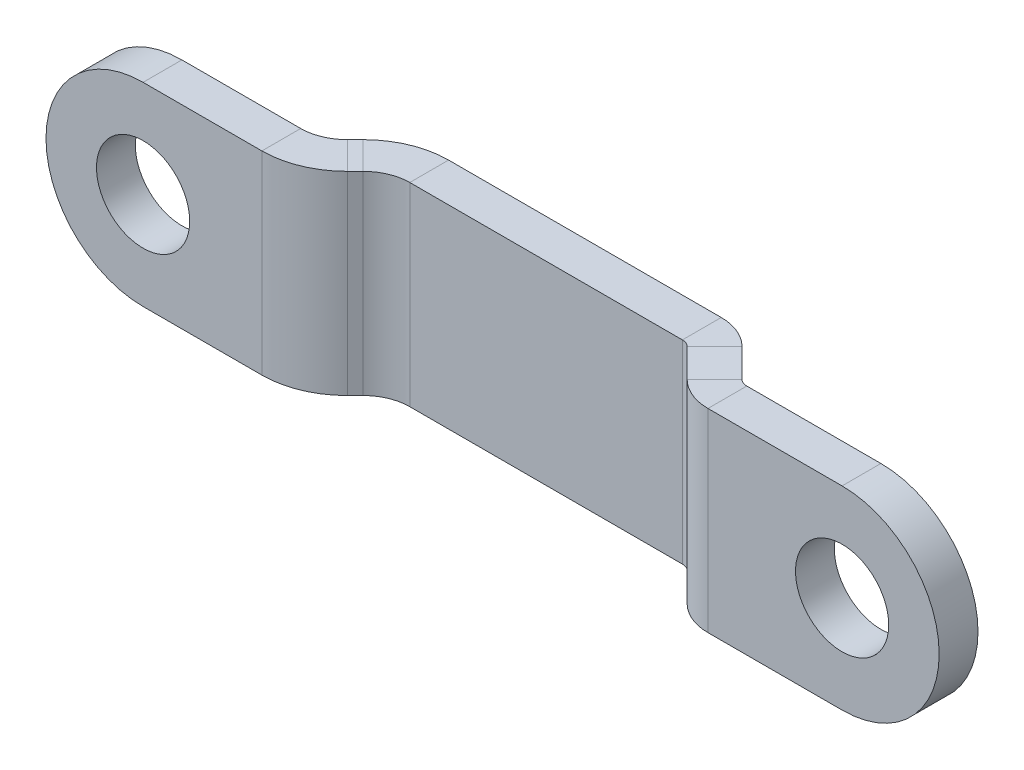
ISO-10303-21;
HEADER;
FILE_DESCRIPTION(('STEP AP214'),'2;1');
FILE_NAME('part.step','',(''),(''),'','','');
FILE_SCHEMA(('AUTOMOTIVE_DESIGN { 1 0 10303 214 1 1 1 1 }'));
ENDSEC;
DATA;
#1=APPLICATION_CONTEXT('core data for automotive mechanical design processes');
#2=APPLICATION_PROTOCOL_DEFINITION('international standard','automotive_design',2000,#1);
#3=PRODUCT_CONTEXT('',#1,'mechanical');
#4=PRODUCT('Part','Part','',(#3));
#5=PRODUCT_RELATED_PRODUCT_CATEGORY('part','',(#4));
#6=PRODUCT_DEFINITION_FORMATION('','',#4);
#7=PRODUCT_DEFINITION_CONTEXT('part definition',#1,'design');
#8=PRODUCT_DEFINITION('design','',#6,#7);
#9=PRODUCT_DEFINITION_SHAPE('','',#8);
#10=(LENGTH_UNIT() NAMED_UNIT(*) SI_UNIT(.MILLI.,.METRE.));
#11=(NAMED_UNIT(*) PLANE_ANGLE_UNIT() SI_UNIT($,.RADIAN.));
#12=(NAMED_UNIT(*) SI_UNIT($,.STERADIAN.) SOLID_ANGLE_UNIT());
#13=UNCERTAINTY_MEASURE_WITH_UNIT(LENGTH_MEASURE(1.E-05),#10,'distance_accuracy_value','');
#14=(GEOMETRIC_REPRESENTATION_CONTEXT(3) GLOBAL_UNCERTAINTY_ASSIGNED_CONTEXT((#13)) GLOBAL_UNIT_ASSIGNED_CONTEXT((#10,
#11,#12)) REPRESENTATION_CONTEXT('',''));
#15=CARTESIAN_POINT('',(0.,0.,0.));
#16=DIRECTION('',(0.,0.,1.));
#17=DIRECTION('',(1.,0.,0.));
#18=AXIS2_PLACEMENT_3D('',#15,#16,#17);
#19=CARTESIAN_POINT('',(-18.5722229666354,6.25,-2.5));
#20=DIRECTION('',(0.,1.,0.));
#21=DIRECTION('',(0.,0.,1.));
#22=AXIS2_PLACEMENT_3D('',#19,#20,#21);
#23=PLANE('',#22);
#24=DIRECTION('',(-1.,0.,0.));
#25=VECTOR('',#24,1.);
#26=CARTESIAN_POINT('',(-18.5722229666354,6.25,0.));
#27=LINE('',#26,#25);
#28=CARTESIAN_POINT('',(13.1476410376619,6.25000000000001,0.));
#29=VERTEX_POINT('',#28);
#30=CARTESIAN_POINT('',(-4.40325186941583,6.25,0.));
#31=VERTEX_POINT('',#30);
#32=EDGE_CURVE('E445',#29,#31,#27,.T.);
#33=ORIENTED_EDGE('',*,*,#32,.F.);
#34=DIRECTION('',(0.,0.,-1.));
#35=VECTOR('',#34,1.);
#36=CARTESIAN_POINT('',(13.1476410376619,6.25,-2.5));
#37=LINE('',#36,#35);
#38=CARTESIAN_POINT('',(13.1476410376619,6.25,-2.5));
#39=VERTEX_POINT('',#38);
#40=EDGE_CURVE('E429',#29,#39,#37,.T.);
#41=ORIENTED_EDGE('',*,*,#40,.T.);
#42=DIRECTION('',(-1.,0.,0.));
#43=VECTOR('',#42,1.);
#44=CARTESIAN_POINT('',(-18.5722229666354,6.25,-2.5));
#45=LINE('',#44,#43);
#46=CARTESIAN_POINT('',(-4.40325186941583,6.24999999999999,-2.5));
#47=VERTEX_POINT('',#46);
#48=EDGE_CURVE('E350',#39,#47,#45,.T.);
#49=ORIENTED_EDGE('',*,*,#48,.T.);
#50=DIRECTION('',(0.,0.,-1.));
#51=VECTOR('',#50,1.);
#52=CARTESIAN_POINT('',(-4.40325186941583,6.25,-2.5));
#53=LINE('',#52,#51);
#54=EDGE_CURVE('E341',#31,#47,#53,.T.);
#55=ORIENTED_EDGE('',*,*,#54,.F.);
#56=EDGE_LOOP('',(#33,#41,#49,#55));
#57=FACE_BOUND('',#56,.T.);
#58=ADVANCED_FACE('F53',(#57),#23,.T.);
#59=CARTESIAN_POINT('',(-18.5722229666354,0.,0.));
#60=DIRECTION('',(0.,0.,1.));
#61=DIRECTION('',(1.,0.,0.));
#62=AXIS2_PLACEMENT_3D('',#59,#60,#61);
#63=PLANE('',#62);
#64=DIRECTION('',(1.,0.,0.));
#65=VECTOR('',#64,1.);
#66=CARTESIAN_POINT('',(-18.5722229666354,-6.25,0.));
#67=LINE('',#66,#65);
#68=CARTESIAN_POINT('',(-4.40325186941583,-6.25,0.));
#69=VERTEX_POINT('',#68);
#70=CARTESIAN_POINT('',(13.1476410376619,-6.25,0.));
#71=VERTEX_POINT('',#70);
#72=EDGE_CURVE('E448',#69,#71,#67,.T.);
#73=ORIENTED_EDGE('',*,*,#72,.T.);
#74=DIRECTION('',(0.,1.,0.));
#75=VECTOR('',#74,1.);
#76=CARTESIAN_POINT('',(13.1476410376619,0.,0.));
#77=LINE('',#76,#75);
#78=EDGE_CURVE('E433',#71,#29,#77,.T.);
#79=ORIENTED_EDGE('',*,*,#78,.T.);
#80=ORIENTED_EDGE('',*,*,#32,.T.);
#81=DIRECTION('',(0.,1.,0.));
#82=VECTOR('',#81,1.);
#83=CARTESIAN_POINT('',(-4.40325186941583,0.,0.));
#84=LINE('',#83,#82);
#85=EDGE_CURVE('E315',#69,#31,#84,.T.);
#86=ORIENTED_EDGE('',*,*,#85,.F.);
#87=EDGE_LOOP('',(#73,#79,#80,#86));
#88=FACE_BOUND('',#87,.T.);
#89=ADVANCED_FACE('F537',(#88),#63,.T.);
#90=CARTESIAN_POINT('',(-18.5722229666354,-6.25,-2.5));
#91=DIRECTION('',(0.,-1.,0.));
#92=DIRECTION('',(0.,0.,-1.));
#93=AXIS2_PLACEMENT_3D('',#90,#91,#92);
#94=PLANE('',#93);
#95=DIRECTION('',(1.,0.,0.));
#96=VECTOR('',#95,1.);
#97=CARTESIAN_POINT('',(-18.5722229666354,-6.25,-2.5));
#98=LINE('',#97,#96);
#99=CARTESIAN_POINT('',(-4.40325186941583,-6.25,-2.5));
#100=VERTEX_POINT('',#99);
#101=CARTESIAN_POINT('',(13.1476410376619,-6.24999999999999,-2.5));
#102=VERTEX_POINT('',#101);
#103=EDGE_CURVE('E320',#100,#102,#98,.T.);
#104=ORIENTED_EDGE('',*,*,#103,.T.);
#105=DIRECTION('',(0.,0.,1.));
#106=VECTOR('',#105,1.);
#107=CARTESIAN_POINT('',(13.1476410376619,-6.25,-2.5));
#108=LINE('',#107,#106);
#109=EDGE_CURVE('E437',#102,#71,#108,.T.);
#110=ORIENTED_EDGE('',*,*,#109,.T.);
#111=ORIENTED_EDGE('',*,*,#72,.F.);
#112=DIRECTION('',(0.,0.,1.));
#113=VECTOR('',#112,1.);
#114=CARTESIAN_POINT('',(-4.40325186941583,-6.25,-2.5));
#115=LINE('',#114,#113);
#116=EDGE_CURVE('E294',#100,#69,#115,.T.);
#117=ORIENTED_EDGE('',*,*,#116,.F.);
#118=EDGE_LOOP('',(#104,#110,#111,#117));
#119=FACE_BOUND('',#118,.T.);
#120=ADVANCED_FACE('F496',(#119),#94,.T.);
#121=CARTESIAN_POINT('',(-18.5722229666354,0.,-2.5));
#122=DIRECTION('',(0.,0.,1.));
#123=DIRECTION('',(1.,0.,0.));
#124=AXIS2_PLACEMENT_3D('',#121,#122,#123);
#125=PLANE('',#124);
#126=DIRECTION('',(0.,1.,0.));
#127=VECTOR('',#126,1.);
#128=CARTESIAN_POINT('',(13.1476410376619,0.,-2.5));
#129=LINE('',#128,#127);
#130=EDGE_CURVE('E426',#102,#39,#129,.T.);
#131=ORIENTED_EDGE('',*,*,#130,.F.);
#132=ORIENTED_EDGE('',*,*,#103,.F.);
#133=DIRECTION('',(0.,1.,0.));
#134=VECTOR('',#133,1.);
#135=CARTESIAN_POINT('',(-4.40325186941583,0.,-2.5));
#136=LINE('',#135,#134);
#137=EDGE_CURVE('E275',#100,#47,#136,.T.);
#138=ORIENTED_EDGE('',*,*,#137,.T.);
#139=ORIENTED_EDGE('',*,*,#48,.F.);
#140=EDGE_LOOP('',(#131,#132,#138,#139));
#141=FACE_BOUND('',#140,.T.);
#142=ADVANCED_FACE('F493',(#141),#125,.F.);
#143=CARTESIAN_POINT('',(-15.9510331503254,0.,6.76960668785753));
#144=DIRECTION('',(0.707106781186549,0.,0.707106781186546));
#145=DIRECTION('',(0.707106781186546,0.,-0.707106781186549));
#146=AXIS2_PLACEMENT_3D('',#143,#144,#145);
#147=PLANE('',#146);
#148=DIRECTION('',(0.707106781186546,0.,-0.707106781186549));
#149=VECTOR('',#148,1.);
#150=CARTESIAN_POINT('',(-15.9510331503254,-6.25,6.76960668785753));
#151=LINE('',#150,#149);
#152=CARTESIAN_POINT('',(-8.80274680602751,-6.25,-0.378679656440339));
#153=VERTEX_POINT('',#152);
#154=CARTESIAN_POINT('',(-8.29233916594185,-6.25,-0.889087296526004));
#155=VERTEX_POINT('',#154);
#156=EDGE_CURVE('E282',#153,#155,#151,.T.);
#157=ORIENTED_EDGE('',*,*,#156,.F.);
#158=DIRECTION('',(0.,1.,0.));
#159=VECTOR('',#158,1.);
#160=CARTESIAN_POINT('',(-8.80274680602751,0.,-0.378679656440342));
#161=LINE('',#160,#159);
#162=CARTESIAN_POINT('',(-8.80274680602751,6.25,-0.378679656440341));
#163=VERTEX_POINT('',#162);
#164=EDGE_CURVE('E316',#153,#163,#161,.T.);
#165=ORIENTED_EDGE('',*,*,#164,.T.);
#166=DIRECTION('',(-0.707106781186546,0.,0.707106781186549));
#167=VECTOR('',#166,1.);
#168=CARTESIAN_POINT('',(-15.9510331503254,6.25,6.76960668785753));
#169=LINE('',#168,#167);
#170=CARTESIAN_POINT('',(-8.29233916594185,6.24999999999999,-0.889087296526001));
#171=VERTEX_POINT('',#170);
#172=EDGE_CURVE('E286',#171,#163,#169,.T.);
#173=ORIENTED_EDGE('',*,*,#172,.F.);
#174=DIRECTION('',(0.,1.,0.));
#175=VECTOR('',#174,1.);
#176=CARTESIAN_POINT('',(-8.29233916594185,0.,-0.889087296526007));
#177=LINE('',#176,#175);
#178=EDGE_CURVE('E329',#155,#171,#177,.T.);
#179=ORIENTED_EDGE('',*,*,#178,.F.);
#180=EDGE_LOOP('',(#157,#165,#173,#179));
#181=FACE_BOUND('',#180,.T.);
#182=ADVANCED_FACE('F546',(#181),#147,.F.);
#183=CARTESIAN_POINT('',(-15.9510331503254,6.25,6.76960668785753));
#184=DIRECTION('',(0.,1.,0.));
#185=DIRECTION('',(0.707106781186549,0.,0.707106781186546));
#186=AXIS2_PLACEMENT_3D('',#183,#184,#185);
#187=PLANE('',#186);
#188=DIRECTION('',(-0.707106781186549,0.,-0.707106781186546));
#189=VECTOR('',#188,1.);
#190=CARTESIAN_POINT('',(-8.80274680602751,6.25,-0.378679656440343));
#191=LINE('',#190,#189);
#192=CARTESIAN_POINT('',(-7.03497985306114,6.25,1.38908729652603));
#193=VERTEX_POINT('',#192);
#194=EDGE_CURVE('E298',#193,#163,#191,.T.);
#195=ORIENTED_EDGE('',*,*,#194,.F.);
#196=DIRECTION('',(-0.707106781186546,0.,0.707106781186549));
#197=VECTOR('',#196,1.);
#198=CARTESIAN_POINT('',(-14.183266197359,6.25,8.5373736408239));
#199=LINE('',#198,#197);
#200=CARTESIAN_POINT('',(-6.52457221297548,6.25,0.878679656440361));
#201=VERTEX_POINT('',#200);
#202=EDGE_CURVE('E291',#201,#193,#199,.T.);
#203=ORIENTED_EDGE('',*,*,#202,.F.);
#204=DIRECTION('',(-0.707106781186549,0.,-0.707106781186546));
#205=VECTOR('',#204,1.);
#206=CARTESIAN_POINT('',(-8.29233916594185,6.25,-0.889087296526008));
#207=LINE('',#206,#205);
#208=EDGE_CURVE('E297',#201,#171,#207,.T.);
#209=ORIENTED_EDGE('',*,*,#208,.T.);
#210=ORIENTED_EDGE('',*,*,#172,.T.);
#211=EDGE_LOOP('',(#195,#203,#209,#210));
#212=FACE_BOUND('',#211,.T.);
#213=ADVANCED_FACE('F551',(#212),#187,.T.);
#214=CARTESIAN_POINT('',(-15.9510331503254,-6.25,6.76960668785753));
#215=DIRECTION('',(0.,-1.,0.));
#216=DIRECTION('',(-0.707106781186549,0.,-0.707106781186546));
#217=AXIS2_PLACEMENT_3D('',#214,#215,#216);
#218=PLANE('',#217);
#219=DIRECTION('',(0.707106781186549,0.,0.707106781186546));
#220=VECTOR('',#219,1.);
#221=CARTESIAN_POINT('',(-8.80274680602751,-6.25,-0.378679656440341));
#222=LINE('',#221,#220);
#223=CARTESIAN_POINT('',(-7.03497985306114,-6.25,1.38908729652603));
#224=VERTEX_POINT('',#223);
#225=EDGE_CURVE('E310',#153,#224,#222,.T.);
#226=ORIENTED_EDGE('',*,*,#225,.F.);
#227=ORIENTED_EDGE('',*,*,#156,.T.);
#228=DIRECTION('',(0.707106781186549,0.,0.707106781186546));
#229=VECTOR('',#228,1.);
#230=CARTESIAN_POINT('',(-8.29233916594185,-6.25,-0.889087296526007));
#231=LINE('',#230,#229);
#232=CARTESIAN_POINT('',(-6.52457221297548,-6.25,0.878679656440362));
#233=VERTEX_POINT('',#232);
#234=EDGE_CURVE('E285',#155,#233,#231,.T.);
#235=ORIENTED_EDGE('',*,*,#234,.T.);
#236=DIRECTION('',(0.707106781186546,0.,-0.707106781186549));
#237=VECTOR('',#236,1.);
#238=CARTESIAN_POINT('',(-14.183266197359,-6.25,8.5373736408239));
#239=LINE('',#238,#237);
#240=EDGE_CURVE('E287',#224,#233,#239,.T.);
#241=ORIENTED_EDGE('',*,*,#240,.F.);
#242=EDGE_LOOP('',(#226,#227,#235,#241));
#243=FACE_BOUND('',#242,.T.);
#244=ADVANCED_FACE('F608',(#243),#218,.T.);
#245=CARTESIAN_POINT('',(-14.183266197359,0.,8.5373736408239));
#246=DIRECTION('',(0.707106781186549,0.,0.707106781186546));
#247=DIRECTION('',(0.707106781186546,0.,-0.707106781186549));
#248=AXIS2_PLACEMENT_3D('',#245,#246,#247);
#249=PLANE('',#248);
#250=DIRECTION('',(0.,1.,0.));
#251=VECTOR('',#250,1.);
#252=CARTESIAN_POINT('',(-7.03497985306114,0.,1.38908729652602));
#253=LINE('',#252,#251);
#254=EDGE_CURVE('E304',#224,#193,#253,.T.);
#255=ORIENTED_EDGE('',*,*,#254,.F.);
#256=ORIENTED_EDGE('',*,*,#240,.T.);
#257=DIRECTION('',(0.,1.,0.));
#258=VECTOR('',#257,1.);
#259=CARTESIAN_POINT('',(-6.52457221297548,0.,0.878679656440359));
#260=LINE('',#259,#258);
#261=EDGE_CURVE('E290',#233,#201,#260,.T.);
#262=ORIENTED_EDGE('',*,*,#261,.T.);
#263=ORIENTED_EDGE('',*,*,#202,.T.);
#264=EDGE_LOOP('',(#255,#256,#262,#263));
#265=FACE_BOUND('',#264,.T.);
#266=ADVANCED_FACE('F606',(#265),#249,.T.);
#267=CARTESIAN_POINT('',(-4.40325186941583,-6.25,3.));
#268=DIRECTION('',(0.,-1.,0.));
#269=DIRECTION('',(0.,0.,-1.));
#270=AXIS2_PLACEMENT_3D('',#267,#268,#269);
#271=PLANE('',#270);
#272=ORIENTED_EDGE('',*,*,#116,.T.);
#273=CARTESIAN_POINT('',(-4.40325186941583,-6.25000000000001,3.));
#274=DIRECTION('',(0.,1.,0.));
#275=DIRECTION('',(-1.,0.,0.));
#276=AXIS2_PLACEMENT_3D('',#273,#274,#275);
#277=CIRCLE('',#276,3.);
#278=EDGE_CURVE('E337',#69,#233,#277,.T.);
#279=ORIENTED_EDGE('',*,*,#278,.T.);
#280=ORIENTED_EDGE('',*,*,#234,.F.);
#281=CARTESIAN_POINT('',(-4.40325186941583,-6.25,3.));
#282=DIRECTION('',(0.,1.,0.));
#283=DIRECTION('',(0.,0.,-1.));
#284=AXIS2_PLACEMENT_3D('',#281,#282,#283);
#285=CIRCLE('',#284,5.5);
#286=EDGE_CURVE('E333',#100,#155,#285,.T.);
#287=ORIENTED_EDGE('',*,*,#286,.F.);
#288=EDGE_LOOP('',(#272,#279,#280,#287));
#289=FACE_BOUND('',#288,.T.);
#290=ADVANCED_FACE('F503',(#289),#271,.T.);
#291=CARTESIAN_POINT('',(-4.40325186941583,6.24999999999999,3.));
#292=DIRECTION('',(0.,1.,0.));
#293=DIRECTION('',(0.,0.,1.));
#294=AXIS2_PLACEMENT_3D('',#291,#292,#293);
#295=PLANE('',#294);
#296=ORIENTED_EDGE('',*,*,#208,.F.);
#297=CARTESIAN_POINT('',(-4.40325186941583,6.24999999999999,3.));
#298=DIRECTION('',(0.,1.,0.));
#299=DIRECTION('',(-1.,0.,0.));
#300=AXIS2_PLACEMENT_3D('',#297,#298,#299);
#301=CIRCLE('',#300,3.);
#302=EDGE_CURVE('E346',#201,#31,#301,.F.);
#303=ORIENTED_EDGE('',*,*,#302,.T.);
#304=ORIENTED_EDGE('',*,*,#54,.T.);
#305=CARTESIAN_POINT('',(-4.40325186941583,6.24999999999999,3.));
#306=DIRECTION('',(0.,-1.,0.));
#307=DIRECTION('',(0.,0.,1.));
#308=AXIS2_PLACEMENT_3D('',#305,#306,#307);
#309=CIRCLE('',#308,5.5);
#310=EDGE_CURVE('E345',#171,#47,#309,.T.);
#311=ORIENTED_EDGE('',*,*,#310,.F.);
#312=EDGE_LOOP('',(#296,#303,#304,#311));
#313=FACE_BOUND('',#312,.T.);
#314=ADVANCED_FACE('F510',(#313),#295,.T.);
#315=CARTESIAN_POINT('',(-4.40325186941582,-13.1773236316567,3.));
#316=DIRECTION('',(0.,1.,0.));
#317=DIRECTION('',(-1.,0.,0.));
#318=AXIS2_PLACEMENT_3D('',#315,#316,#317);
#319=CYLINDRICAL_SURFACE('',#318,5.5);
#320=ORIENTED_EDGE('',*,*,#310,.T.);
#321=ORIENTED_EDGE('',*,*,#137,.F.);
#322=ORIENTED_EDGE('',*,*,#286,.T.);
#323=ORIENTED_EDGE('',*,*,#178,.T.);
#324=EDGE_LOOP('',(#320,#321,#322,#323));
#325=FACE_BOUND('',#324,.T.);
#326=ADVANCED_FACE('F505',(#325),#319,.T.);
#327=CARTESIAN_POINT('',(-4.40325186941582,-13.1773236316567,3.));
#328=DIRECTION('',(0.,1.,0.));
#329=DIRECTION('',(-1.,0.,0.));
#330=AXIS2_PLACEMENT_3D('',#327,#328,#329);
#331=CYLINDRICAL_SURFACE('',#330,3.);
#332=ORIENTED_EDGE('',*,*,#302,.F.);
#333=ORIENTED_EDGE('',*,*,#261,.F.);
#334=ORIENTED_EDGE('',*,*,#278,.F.);
#335=ORIENTED_EDGE('',*,*,#85,.T.);
#336=EDGE_LOOP('',(#332,#333,#334,#335));
#337=FACE_BOUND('',#336,.T.);
#338=ADVANCED_FACE('F596',(#337),#331,.F.);
#339=CARTESIAN_POINT('',(-10.9240671495872,-6.25,-2.49999999999998));
#340=DIRECTION('',(0.,1.,0.));
#341=DIRECTION('',(0.,0.,1.));
#342=AXIS2_PLACEMENT_3D('',#339,#340,#341);
#343=PLANE('',#342);
#344=ORIENTED_EDGE('',*,*,#225,.T.);
#345=CARTESIAN_POINT('',(-10.9240671495872,-6.25,-2.49999999999998));
#346=DIRECTION('',(0.,1.,0.));
#347=DIRECTION('',(0.,0.,1.));
#348=AXIS2_PLACEMENT_3D('',#345,#346,#347);
#349=CIRCLE('',#348,5.5);
#350=CARTESIAN_POINT('',(-10.9240671495872,-6.25,3.00000000000002));
#351=VERTEX_POINT('',#350);
#352=EDGE_CURVE('E314',#224,#351,#349,.F.);
#353=ORIENTED_EDGE('',*,*,#352,.T.);
#354=DIRECTION('',(0.,0.,1.));
#355=VECTOR('',#354,1.);
#356=CARTESIAN_POINT('',(-10.9240671495872,-6.25,0.500000000000019));
#357=LINE('',#356,#355);
#358=CARTESIAN_POINT('',(-10.9240671495872,-6.25,0.50000000000002));
#359=VERTEX_POINT('',#358);
#360=EDGE_CURVE('E398',#359,#351,#357,.T.);
#361=ORIENTED_EDGE('',*,*,#360,.F.);
#362=CARTESIAN_POINT('',(-10.9240671495872,-6.25,-2.49999999999998));
#363=DIRECTION('',(0.,-1.,0.));
#364=DIRECTION('',(0.,0.,1.));
#365=AXIS2_PLACEMENT_3D('',#362,#363,#364);
#366=CIRCLE('',#365,3.);
#367=EDGE_CURVE('E372',#153,#359,#366,.T.);
#368=ORIENTED_EDGE('',*,*,#367,.F.);
#369=EDGE_LOOP('',(#344,#353,#361,#368));
#370=FACE_BOUND('',#369,.T.);
#371=ADVANCED_FACE('F592',(#370),#343,.F.);
#372=CARTESIAN_POINT('',(-10.9240671495872,6.25,-2.49999999999998));
#373=DIRECTION('',(0.,-1.,0.));
#374=DIRECTION('',(0.,0.,-1.));
#375=AXIS2_PLACEMENT_3D('',#372,#373,#374);
#376=PLANE('',#375);
#377=DIRECTION('',(0.,0.,-1.));
#378=VECTOR('',#377,1.);
#379=CARTESIAN_POINT('',(-10.9240671495872,6.25,0.500000000000019));
#380=LINE('',#379,#378);
#381=CARTESIAN_POINT('',(-10.9240671495872,6.25,3.00000000000002));
#382=VERTEX_POINT('',#381);
#383=CARTESIAN_POINT('',(-10.9240671495872,6.25,0.500000000000018));
#384=VERTEX_POINT('',#383);
#385=EDGE_CURVE('E416',#382,#384,#380,.T.);
#386=ORIENTED_EDGE('',*,*,#385,.F.);
#387=CARTESIAN_POINT('',(-10.9240671495872,6.25,-2.49999999999998));
#388=DIRECTION('',(0.,1.,0.));
#389=DIRECTION('',(0.,0.,1.));
#390=AXIS2_PLACEMENT_3D('',#387,#388,#389);
#391=CIRCLE('',#390,5.5);
#392=EDGE_CURVE('E303',#382,#193,#391,.T.);
#393=ORIENTED_EDGE('',*,*,#392,.T.);
#394=ORIENTED_EDGE('',*,*,#194,.T.);
#395=CARTESIAN_POINT('',(-10.9240671495872,6.25,-2.49999999999998));
#396=DIRECTION('',(0.,1.,0.));
#397=DIRECTION('',(0.,0.,-1.));
#398=AXIS2_PLACEMENT_3D('',#395,#396,#397);
#399=CIRCLE('',#398,3.);
#400=EDGE_CURVE('E302',#384,#163,#399,.T.);
#401=ORIENTED_EDGE('',*,*,#400,.F.);
#402=EDGE_LOOP('',(#386,#393,#394,#401));
#403=FACE_BOUND('',#402,.T.);
#404=ADVANCED_FACE('F585',(#403),#376,.F.);
#405=CARTESIAN_POINT('',(-10.9240671495872,-13.7960707835823,-2.49999999999998));
#406=DIRECTION('',(0.,1.,0.));
#407=DIRECTION('',(0.,0.,1.));
#408=AXIS2_PLACEMENT_3D('',#405,#406,#407);
#409=CYLINDRICAL_SURFACE('',#408,3.);
#410=ORIENTED_EDGE('',*,*,#400,.T.);
#411=ORIENTED_EDGE('',*,*,#164,.F.);
#412=ORIENTED_EDGE('',*,*,#367,.T.);
#413=DIRECTION('',(0.,1.,0.));
#414=VECTOR('',#413,1.);
#415=CARTESIAN_POINT('',(-10.9240671495872,0.,0.500000000000019));
#416=LINE('',#415,#414);
#417=EDGE_CURVE('E309',#359,#384,#416,.T.);
#418=ORIENTED_EDGE('',*,*,#417,.T.);
#419=EDGE_LOOP('',(#410,#411,#412,#418));
#420=FACE_BOUND('',#419,.T.);
#421=ADVANCED_FACE('F582',(#420),#409,.F.);
#422=CARTESIAN_POINT('',(-10.9240671495872,-13.7960707835823,-2.49999999999998));
#423=DIRECTION('',(0.,1.,0.));
#424=DIRECTION('',(0.,0.,1.));
#425=AXIS2_PLACEMENT_3D('',#422,#423,#424);
#426=CYLINDRICAL_SURFACE('',#425,5.5);
#427=ORIENTED_EDGE('',*,*,#392,.F.);
#428=DIRECTION('',(0.,1.,0.));
#429=VECTOR('',#428,1.);
#430=CARTESIAN_POINT('',(-10.9240671495872,0.,3.00000000000002));
#431=LINE('',#430,#429);
#432=EDGE_CURVE('E405',#351,#382,#431,.T.);
#433=ORIENTED_EDGE('',*,*,#432,.F.);
#434=ORIENTED_EDGE('',*,*,#352,.F.);
#435=ORIENTED_EDGE('',*,*,#254,.T.);
#436=EDGE_LOOP('',(#427,#433,#434,#435));
#437=FACE_BOUND('',#436,.T.);
#438=ADVANCED_FACE('F561',(#437),#426,.T.);
#439=CARTESIAN_POINT('',(-18.5722229666354,0.,0.50000000000002));
#440=DIRECTION('',(0.,0.,1.));
#441=DIRECTION('',(1.,0.,0.));
#442=AXIS2_PLACEMENT_3D('',#439,#440,#441);
#443=CYLINDRICAL_SURFACE('',#442,3.);
#444=CARTESIAN_POINT('',(-18.5722229666354,0.,0.50000000000002));
#445=DIRECTION('',(0.,0.,1.));
#446=DIRECTION('',(1.,0.,0.));
#447=AXIS2_PLACEMENT_3D('',#444,#445,#446);
#448=CIRCLE('',#447,3.);
#449=CARTESIAN_POINT('',(-15.5722229666354,0.,0.50000000000002));
#450=VERTEX_POINT('',#449);
#451=EDGE_CURVE('E390',#450,#450,#448,.T.);
#452=ORIENTED_EDGE('',*,*,#451,.F.);
#453=EDGE_LOOP('',(#452));
#454=FACE_BOUND('',#453,.T.);
#455=CARTESIAN_POINT('',(-18.5722229666354,0.,3.00000000000002));
#456=DIRECTION('',(0.,0.,1.));
#457=DIRECTION('',(1.,0.,0.));
#458=AXIS2_PLACEMENT_3D('',#455,#456,#457);
#459=CIRCLE('',#458,3.);
#460=CARTESIAN_POINT('',(-15.5722229666354,0.,3.00000000000002));
#461=VERTEX_POINT('',#460);
#462=EDGE_CURVE('E308',#461,#461,#459,.T.);
#463=ORIENTED_EDGE('',*,*,#462,.T.);
#464=EDGE_LOOP('',(#463));
#465=FACE_BOUND('',#464,.T.);
#466=ADVANCED_FACE('F557',(#454,#465),#443,.F.);
#467=CARTESIAN_POINT('',(-18.5722229666354,0.,0.50000000000002));
#468=DIRECTION('',(0.,0.,1.));
#469=DIRECTION('',(1.,0.,0.));
#470=AXIS2_PLACEMENT_3D('',#467,#468,#469);
#471=CYLINDRICAL_SURFACE('',#470,6.25);
#472=CARTESIAN_POINT('',(-18.5722229666354,0.,3.00000000000002));
#473=DIRECTION('',(0.,0.,1.));
#474=DIRECTION('',(1.,0.,0.));
#475=AXIS2_PLACEMENT_3D('',#472,#473,#474);
#476=CIRCLE('',#475,6.25);
#477=CARTESIAN_POINT('',(-18.5722229666354,6.25,3.00000000000002));
#478=VERTEX_POINT('',#477);
#479=CARTESIAN_POINT('',(-18.5722229666354,-6.25,3.00000000000002));
#480=VERTEX_POINT('',#479);
#481=EDGE_CURVE('E412',#478,#480,#476,.T.);
#482=ORIENTED_EDGE('',*,*,#481,.F.);
#483=DIRECTION('',(0.,0.,1.));
#484=VECTOR('',#483,1.);
#485=CARTESIAN_POINT('',(-18.5722229666354,6.25,0.50000000000002));
#486=LINE('',#485,#484);
#487=CARTESIAN_POINT('',(-18.5722229666354,6.25,0.50000000000002));
#488=VERTEX_POINT('',#487);
#489=EDGE_CURVE('E422',#488,#478,#486,.T.);
#490=ORIENTED_EDGE('',*,*,#489,.F.);
#491=CARTESIAN_POINT('',(-18.5722229666354,0.,0.50000000000002));
#492=DIRECTION('',(0.,0.,1.));
#493=DIRECTION('',(1.,0.,0.));
#494=AXIS2_PLACEMENT_3D('',#491,#492,#493);
#495=CIRCLE('',#494,6.25);
#496=CARTESIAN_POINT('',(-18.5722229666354,-6.25,0.50000000000002));
#497=VERTEX_POINT('',#496);
#498=EDGE_CURVE('E382',#488,#497,#495,.T.);
#499=ORIENTED_EDGE('',*,*,#498,.T.);
#500=DIRECTION('',(0.,0.,1.));
#501=VECTOR('',#500,1.);
#502=CARTESIAN_POINT('',(-18.5722229666354,-6.25,0.50000000000002));
#503=LINE('',#502,#501);
#504=EDGE_CURVE('E386',#497,#480,#503,.T.);
#505=ORIENTED_EDGE('',*,*,#504,.T.);
#506=EDGE_LOOP('',(#482,#490,#499,#505));
#507=FACE_BOUND('',#506,.T.);
#508=ADVANCED_FACE('F560',(#507),#471,.T.);
#509=CARTESIAN_POINT('',(-17.6953284509804,0.,0.50000000000002));
#510=DIRECTION('',(0.,0.,1.));
#511=DIRECTION('',(1.,0.,0.));
#512=AXIS2_PLACEMENT_3D('',#509,#510,#511);
#513=PLANE('',#512);
#514=ORIENTED_EDGE('',*,*,#417,.F.);
#515=DIRECTION('',(1.,0.,0.));
#516=VECTOR('',#515,1.);
#517=CARTESIAN_POINT('',(-17.6953284509804,-6.25,0.50000000000002));
#518=LINE('',#517,#516);
#519=EDGE_CURVE('E394',#497,#359,#518,.T.);
#520=ORIENTED_EDGE('',*,*,#519,.F.);
#521=ORIENTED_EDGE('',*,*,#498,.F.);
#522=DIRECTION('',(-1.,0.,0.));
#523=VECTOR('',#522,1.);
#524=CARTESIAN_POINT('',(-17.6953284509804,6.25,0.50000000000002));
#525=LINE('',#524,#523);
#526=EDGE_CURVE('E419',#384,#488,#525,.T.);
#527=ORIENTED_EDGE('',*,*,#526,.F.);
#528=EDGE_LOOP('',(#514,#520,#521,#527));
#529=FACE_BOUND('',#528,.T.);
#530=ORIENTED_EDGE('',*,*,#451,.T.);
#531=EDGE_LOOP('',(#530));
#532=FACE_BOUND('',#531,.T.);
#533=ADVANCED_FACE('F565',(#529,#532),#513,.F.);
#534=CARTESIAN_POINT('',(-17.6953284509804,-6.25,0.50000000000002));
#535=DIRECTION('',(0.,-1.,0.));
#536=DIRECTION('',(0.,0.,-1.));
#537=AXIS2_PLACEMENT_3D('',#534,#535,#536);
#538=PLANE('',#537);
#539=ORIENTED_EDGE('',*,*,#519,.T.);
#540=ORIENTED_EDGE('',*,*,#360,.T.);
#541=DIRECTION('',(1.,0.,0.));
#542=VECTOR('',#541,1.);
#543=CARTESIAN_POINT('',(-17.6953284509804,-6.25,3.00000000000002));
#544=LINE('',#543,#542);
#545=EDGE_CURVE('E402',#480,#351,#544,.T.);
#546=ORIENTED_EDGE('',*,*,#545,.F.);
#547=ORIENTED_EDGE('',*,*,#504,.F.);
#548=EDGE_LOOP('',(#539,#540,#546,#547));
#549=FACE_BOUND('',#548,.T.);
#550=ADVANCED_FACE('F569',(#549),#538,.T.);
#551=CARTESIAN_POINT('',(-17.6953284509804,0.,3.00000000000002));
#552=DIRECTION('',(0.,0.,1.));
#553=DIRECTION('',(1.,0.,0.));
#554=AXIS2_PLACEMENT_3D('',#551,#552,#553);
#555=PLANE('',#554);
#556=ORIENTED_EDGE('',*,*,#462,.F.);
#557=EDGE_LOOP('',(#556));
#558=FACE_BOUND('',#557,.T.);
#559=ORIENTED_EDGE('',*,*,#545,.T.);
#560=ORIENTED_EDGE('',*,*,#432,.T.);
#561=DIRECTION('',(-1.,0.,0.));
#562=VECTOR('',#561,1.);
#563=CARTESIAN_POINT('',(-17.6953284509804,6.25,3.00000000000002));
#564=LINE('',#563,#562);
#565=EDGE_CURVE('E409',#382,#478,#564,.T.);
#566=ORIENTED_EDGE('',*,*,#565,.T.);
#567=ORIENTED_EDGE('',*,*,#481,.T.);
#568=EDGE_LOOP('',(#559,#560,#566,#567));
#569=FACE_BOUND('',#568,.T.);
#570=ADVANCED_FACE('F573',(#558,#569),#555,.T.);
#571=CARTESIAN_POINT('',(-17.6953284509804,6.25,0.50000000000002));
#572=DIRECTION('',(0.,1.,0.));
#573=DIRECTION('',(0.,0.,1.));
#574=AXIS2_PLACEMENT_3D('',#571,#572,#573);
#575=PLANE('',#574);
#576=ORIENTED_EDGE('',*,*,#565,.F.);
#577=ORIENTED_EDGE('',*,*,#385,.T.);
#578=ORIENTED_EDGE('',*,*,#526,.T.);
#579=ORIENTED_EDGE('',*,*,#489,.T.);
#580=EDGE_LOOP('',(#576,#577,#578,#579));
#581=FACE_BOUND('',#580,.T.);
#582=ADVANCED_FACE('F577',(#581),#575,.T.);
#583=CARTESIAN_POINT('',(13.1476410376619,-6.24999999999999,0.7366));
#584=DIRECTION('',(0.,-1.,0.));
#585=DIRECTION('',(0.,0.,-1.));
#586=AXIS2_PLACEMENT_3D('',#583,#584,#585);
#587=PLANE('',#586);
#588=DIRECTION('',(-0.707106781186549,0.,0.707106781186546));
#589=VECTOR('',#588,1.);
#590=CARTESIAN_POINT('',(15.4362628456503,-6.25,-1.55202180798837));
#591=LINE('',#590,#589);
#592=CARTESIAN_POINT('',(15.4362628456503,-6.25,-1.55202180798838));
#593=VERTEX_POINT('',#592);
#594=CARTESIAN_POINT('',(13.6684958926839,-6.25,0.21574514497799));
#595=VERTEX_POINT('',#594);
#596=EDGE_CURVE('E247',#593,#595,#591,.T.);
#597=ORIENTED_EDGE('',*,*,#596,.T.);
#598=CARTESIAN_POINT('',(13.1476410376619,-6.24999999999999,0.7366));
#599=DIRECTION('',(0.,-1.,0.));
#600=DIRECTION('',(1.,0.,0.));
#601=AXIS2_PLACEMENT_3D('',#598,#599,#600);
#602=CIRCLE('',#601,0.7366);
#603=EDGE_CURVE('E79',#595,#71,#602,.F.);
#604=ORIENTED_EDGE('',*,*,#603,.T.);
#605=ORIENTED_EDGE('',*,*,#109,.F.);
#606=CARTESIAN_POINT('',(13.1476410376619,-6.24999999999999,0.7366));
#607=DIRECTION('',(0.,1.,0.));
#608=DIRECTION('',(0.,0.,-1.));
#609=AXIS2_PLACEMENT_3D('',#606,#607,#608);
#610=CIRCLE('',#609,3.2366);
#611=EDGE_CURVE('E266',#593,#102,#610,.T.);
#612=ORIENTED_EDGE('',*,*,#611,.F.);
#613=EDGE_LOOP('',(#597,#604,#605,#612));
#614=FACE_BOUND('',#613,.T.);
#615=ADVANCED_FACE('F518',(#614),#587,.T.);
#616=CARTESIAN_POINT('',(13.1476410376619,6.25,0.7366));
#617=DIRECTION('',(0.,1.,0.));
#618=DIRECTION('',(0.,0.,1.));
#619=AXIS2_PLACEMENT_3D('',#616,#617,#618);
#620=PLANE('',#619);
#621=ORIENTED_EDGE('',*,*,#40,.F.);
#622=CARTESIAN_POINT('',(13.1476410376619,6.25000000000001,0.7366));
#623=DIRECTION('',(0.,-1.,0.));
#624=DIRECTION('',(1.,0.,0.));
#625=AXIS2_PLACEMENT_3D('',#622,#623,#624);
#626=CIRCLE('',#625,0.7366);
#627=CARTESIAN_POINT('',(13.6684958926839,6.25,0.21574514497799));
#628=VERTEX_POINT('',#627);
#629=EDGE_CURVE('E271',#29,#628,#626,.T.);
#630=ORIENTED_EDGE('',*,*,#629,.T.);
#631=DIRECTION('',(0.707106781186549,0.,-0.707106781186546));
#632=VECTOR('',#631,1.);
#633=CARTESIAN_POINT('',(15.4362628456503,6.25,-1.55202180798837));
#634=LINE('',#633,#632);
#635=CARTESIAN_POINT('',(15.4362628456503,6.25,-1.55202180798839));
#636=VERTEX_POINT('',#635);
#637=EDGE_CURVE('E256',#628,#636,#634,.T.);
#638=ORIENTED_EDGE('',*,*,#637,.T.);
#639=CARTESIAN_POINT('',(13.1476410376619,6.25,0.7366));
#640=DIRECTION('',(0.,-1.,0.));
#641=DIRECTION('',(0.,0.,1.));
#642=AXIS2_PLACEMENT_3D('',#639,#640,#641);
#643=CIRCLE('',#642,3.2366);
#644=EDGE_CURVE('E270',#39,#636,#643,.T.);
#645=ORIENTED_EDGE('',*,*,#644,.F.);
#646=EDGE_LOOP('',(#621,#630,#638,#645));
#647=FACE_BOUND('',#646,.T.);
#648=ADVANCED_FACE('F484',(#647),#620,.T.);
#649=CARTESIAN_POINT('',(13.1476410376619,12.8426807437997,0.7366));
#650=DIRECTION('',(0.,-1.,0.));
#651=DIRECTION('',(1.,0.,0.));
#652=AXIS2_PLACEMENT_3D('',#649,#650,#651);
#653=CYLINDRICAL_SURFACE('',#652,3.2366);
#654=ORIENTED_EDGE('',*,*,#644,.T.);
#655=DIRECTION('',(0.,1.,0.));
#656=VECTOR('',#655,1.);
#657=CARTESIAN_POINT('',(15.4362628456503,0.,-1.55202180798837));
#658=LINE('',#657,#656);
#659=EDGE_CURVE('E253',#593,#636,#658,.T.);
#660=ORIENTED_EDGE('',*,*,#659,.F.);
#661=ORIENTED_EDGE('',*,*,#611,.T.);
#662=ORIENTED_EDGE('',*,*,#130,.T.);
#663=EDGE_LOOP('',(#654,#660,#661,#662));
#664=FACE_BOUND('',#663,.T.);
#665=ADVANCED_FACE('F489',(#664),#653,.T.);
#666=CARTESIAN_POINT('',(13.1476410376619,12.8426807437997,0.7366));
#667=DIRECTION('',(0.,-1.,0.));
#668=DIRECTION('',(1.,0.,0.));
#669=AXIS2_PLACEMENT_3D('',#666,#667,#668);
#670=CYLINDRICAL_SURFACE('',#669,0.7366);
#671=ORIENTED_EDGE('',*,*,#629,.F.);
#672=ORIENTED_EDGE('',*,*,#78,.F.);
#673=ORIENTED_EDGE('',*,*,#603,.F.);
#674=DIRECTION('',(0.,1.,0.));
#675=VECTOR('',#674,1.);
#676=CARTESIAN_POINT('',(13.6684958926839,0.,0.215745144977998));
#677=LINE('',#676,#675);
#678=EDGE_CURVE('E260',#595,#628,#677,.T.);
#679=ORIENTED_EDGE('',*,*,#678,.T.);
#680=EDGE_LOOP('',(#671,#672,#673,#679));
#681=FACE_BOUND('',#680,.T.);
#682=ADVANCED_FACE('F515',(#681),#670,.F.);
#683=CARTESIAN_POINT('',(-8.09634699572156,0.,-25.0846316493603));
#684=DIRECTION('',(-0.707106781186549,0.,0.707106781186546));
#685=DIRECTION('',(0.707106781186546,0.,0.707106781186549));
#686=AXIS2_PLACEMENT_3D('',#683,#684,#685);
#687=PLANE('',#686);
#688=DIRECTION('',(0.,1.,0.));
#689=VECTOR('',#688,1.);
#690=CARTESIAN_POINT('',(17.2725395086607,0.,0.284254855022027));
#691=LINE('',#690,#689);
#692=CARTESIAN_POINT('',(17.2725395086607,-6.25,0.284254855022016));
#693=VERTEX_POINT('',#692);
#694=CARTESIAN_POINT('',(17.2725395086607,6.25,0.284254855022016));
#695=VERTEX_POINT('',#694);
#696=EDGE_CURVE('E441',#693,#695,#691,.T.);
#697=ORIENTED_EDGE('',*,*,#696,.F.);
#698=DIRECTION('',(0.707106781186546,0.,0.707106781186549));
#699=VECTOR('',#698,1.);
#700=CARTESIAN_POINT('',(-8.09634699572156,-6.25,-25.0846316493603));
#701=LINE('',#700,#699);
#702=EDGE_CURVE('E281',#593,#693,#701,.T.);
#703=ORIENTED_EDGE('',*,*,#702,.F.);
#704=ORIENTED_EDGE('',*,*,#659,.T.);
#705=DIRECTION('',(-0.707106781186546,0.,-0.707106781186549));
#706=VECTOR('',#705,1.);
#707=CARTESIAN_POINT('',(-8.09634699572156,6.25,-25.0846316493603));
#708=LINE('',#707,#706);
#709=EDGE_CURVE('E57',#695,#636,#708,.T.);
#710=ORIENTED_EDGE('',*,*,#709,.F.);
#711=EDGE_LOOP('',(#697,#703,#704,#710));
#712=FACE_BOUND('',#711,.T.);
#713=ADVANCED_FACE('F526',(#712),#687,.F.);
#714=CARTESIAN_POINT('',(-8.09634699572156,6.25,-25.0846316493603));
#715=DIRECTION('',(0.,1.,0.));
#716=DIRECTION('',(-0.707106781186549,0.,0.707106781186546));
#717=AXIS2_PLACEMENT_3D('',#714,#715,#716);
#718=PLANE('',#717);
#719=DIRECTION('',(-0.707106781186546,0.,-0.707106781186549));
#720=VECTOR('',#719,1.);
#721=CARTESIAN_POINT('',(-9.86411394868794,6.25,-23.3168646963939));
#722=LINE('',#721,#720);
#723=CARTESIAN_POINT('',(15.5047725556943,6.25,2.05202180798835));
#724=VERTEX_POINT('',#723);
#725=EDGE_CURVE('E466',#724,#628,#722,.T.);
#726=ORIENTED_EDGE('',*,*,#725,.F.);
#727=DIRECTION('',(0.707106781186549,0.,-0.707106781186546));
#728=VECTOR('',#727,1.);
#729=CARTESIAN_POINT('',(17.2725395086607,6.25,0.284254855022027));
#730=LINE('',#729,#728);
#731=EDGE_CURVE('E456',#724,#695,#730,.T.);
#732=ORIENTED_EDGE('',*,*,#731,.T.);
#733=ORIENTED_EDGE('',*,*,#709,.T.);
#734=ORIENTED_EDGE('',*,*,#637,.F.);
#735=EDGE_LOOP('',(#726,#732,#733,#734));
#736=FACE_BOUND('',#735,.T.);
#737=ADVANCED_FACE('F479',(#736),#718,.T.);
#738=CARTESIAN_POINT('',(-9.86411394868794,0.,-23.3168646963939));
#739=DIRECTION('',(-0.707106781186549,0.,0.707106781186546));
#740=DIRECTION('',(0.707106781186546,0.,0.707106781186549));
#741=AXIS2_PLACEMENT_3D('',#738,#739,#740);
#742=PLANE('',#741);
#743=DIRECTION('',(0.707106781186546,0.,0.707106781186549));
#744=VECTOR('',#743,1.);
#745=CARTESIAN_POINT('',(-9.86411394868794,-6.25,-23.3168646963939));
#746=LINE('',#745,#744);
#747=CARTESIAN_POINT('',(15.5047725556943,-6.25,2.05202180798838));
#748=VERTEX_POINT('',#747);
#749=EDGE_CURVE('E468',#595,#748,#746,.T.);
#750=ORIENTED_EDGE('',*,*,#749,.T.);
#751=DIRECTION('',(0.,1.,0.));
#752=VECTOR('',#751,1.);
#753=CARTESIAN_POINT('',(15.5047725556943,0.,2.05202180798839));
#754=LINE('',#753,#752);
#755=EDGE_CURVE('E63',#748,#724,#754,.T.);
#756=ORIENTED_EDGE('',*,*,#755,.T.);
#757=ORIENTED_EDGE('',*,*,#725,.T.);
#758=ORIENTED_EDGE('',*,*,#678,.F.);
#759=EDGE_LOOP('',(#750,#756,#757,#758));
#760=FACE_BOUND('',#759,.T.);
#761=ADVANCED_FACE('F516',(#760),#742,.T.);
#762=CARTESIAN_POINT('',(-8.09634699572156,-6.25,-25.0846316493603));
#763=DIRECTION('',(0.,-1.,0.));
#764=DIRECTION('',(0.707106781186549,0.,-0.707106781186546));
#765=AXIS2_PLACEMENT_3D('',#762,#763,#764);
#766=PLANE('',#765);
#767=ORIENTED_EDGE('',*,*,#702,.T.);
#768=DIRECTION('',(-0.707106781186549,0.,0.707106781186546));
#769=VECTOR('',#768,1.);
#770=CARTESIAN_POINT('',(17.2725395086607,-6.25,0.284254855022027));
#771=LINE('',#770,#769);
#772=EDGE_CURVE('E12',#693,#748,#771,.T.);
#773=ORIENTED_EDGE('',*,*,#772,.T.);
#774=ORIENTED_EDGE('',*,*,#749,.F.);
#775=ORIENTED_EDGE('',*,*,#596,.F.);
#776=EDGE_LOOP('',(#767,#773,#774,#775));
#777=FACE_BOUND('',#776,.T.);
#778=ADVANCED_FACE('F55',(#777),#766,.T.);
#779=CARTESIAN_POINT('',(17.7933943636827,-6.25,-0.236599999999983));
#780=DIRECTION('',(0.,1.,0.));
#781=DIRECTION('',(0.,0.,1.));
#782=AXIS2_PLACEMENT_3D('',#779,#780,#781);
#783=PLANE('',#782);
#784=DIRECTION('',(0.,0.,1.));
#785=VECTOR('',#784,1.);
#786=CARTESIAN_POINT('',(17.7933943636827,-6.25,0.500000000000007));
#787=LINE('',#786,#785);
#788=CARTESIAN_POINT('',(17.7933943636827,-6.25,0.500000000000009));
#789=VERTEX_POINT('',#788);
#790=CARTESIAN_POINT('',(17.7933943636827,-6.25,3.00000000000001));
#791=VERTEX_POINT('',#790);
#792=EDGE_CURVE('E200',#789,#791,#787,.T.);
#793=ORIENTED_EDGE('',*,*,#792,.T.);
#794=CARTESIAN_POINT('',(17.7933943636827,-6.25,-0.236599999999983));
#795=DIRECTION('',(0.,-1.,0.));
#796=DIRECTION('',(0.,0.,-1.));
#797=AXIS2_PLACEMENT_3D('',#794,#795,#796);
#798=CIRCLE('',#797,3.2366);
#799=EDGE_CURVE('E71',#791,#748,#798,.T.);
#800=ORIENTED_EDGE('',*,*,#799,.T.);
#801=ORIENTED_EDGE('',*,*,#772,.F.);
#802=CARTESIAN_POINT('',(17.7933943636827,-6.25,-0.236599999999983));
#803=DIRECTION('',(0.,-1.,0.));
#804=DIRECTION('',(0.,0.,1.));
#805=AXIS2_PLACEMENT_3D('',#802,#803,#804);
#806=CIRCLE('',#805,0.7366);
#807=EDGE_CURVE('E238',#789,#693,#806,.T.);
#808=ORIENTED_EDGE('',*,*,#807,.F.);
#809=EDGE_LOOP('',(#793,#800,#801,#808));
#810=FACE_BOUND('',#809,.T.);
#811=ADVANCED_FACE('F520',(#810),#783,.F.);
#812=CARTESIAN_POINT('',(17.7933943636827,6.25,-0.236599999999984));
#813=DIRECTION('',(0.,-1.,0.));
#814=DIRECTION('',(0.,0.,-1.));
#815=AXIS2_PLACEMENT_3D('',#812,#813,#814);
#816=PLANE('',#815);
#817=ORIENTED_EDGE('',*,*,#731,.F.);
#818=CARTESIAN_POINT('',(17.7933943636827,6.25,-0.236599999999984));
#819=DIRECTION('',(0.,-1.,0.));
#820=DIRECTION('',(0.,0.,-1.));
#821=AXIS2_PLACEMENT_3D('',#818,#819,#820);
#822=CIRCLE('',#821,3.2366);
#823=CARTESIAN_POINT('',(17.7933943636827,6.25,3.00000000000001));
#824=VERTEX_POINT('',#823);
#825=EDGE_CURVE('E243',#724,#824,#822,.F.);
#826=ORIENTED_EDGE('',*,*,#825,.T.);
#827=DIRECTION('',(0.,0.,-1.));
#828=VECTOR('',#827,1.);
#829=CARTESIAN_POINT('',(17.7933943636827,6.25,0.500000000000007));
#830=LINE('',#829,#828);
#831=CARTESIAN_POINT('',(17.7933943636827,6.25,0.500000000000016));
#832=VERTEX_POINT('',#831);
#833=EDGE_CURVE('E222',#824,#832,#830,.T.);
#834=ORIENTED_EDGE('',*,*,#833,.T.);
#835=CARTESIAN_POINT('',(17.7933943636827,6.25,-0.236599999999984));
#836=DIRECTION('',(0.,1.,0.));
#837=DIRECTION('',(0.,0.,-1.));
#838=AXIS2_PLACEMENT_3D('',#835,#836,#837);
#839=CIRCLE('',#838,0.7366);
#840=EDGE_CURVE('E242',#695,#832,#839,.T.);
#841=ORIENTED_EDGE('',*,*,#840,.F.);
#842=EDGE_LOOP('',(#817,#826,#834,#841));
#843=FACE_BOUND('',#842,.T.);
#844=ADVANCED_FACE('F626',(#843),#816,.F.);
#845=CARTESIAN_POINT('',(17.7933943636827,13.1428995523892,-0.236599999999985));
#846=DIRECTION('',(0.,-1.,0.));
#847=DIRECTION('',(0.,0.,-1.));
#848=AXIS2_PLACEMENT_3D('',#845,#846,#847);
#849=CYLINDRICAL_SURFACE('',#848,0.7366);
#850=ORIENTED_EDGE('',*,*,#840,.T.);
#851=DIRECTION('',(0.,1.,0.));
#852=VECTOR('',#851,1.);
#853=CARTESIAN_POINT('',(17.7933943636827,0.,0.500000000000007));
#854=LINE('',#853,#852);
#855=EDGE_CURVE('E525',#789,#832,#854,.T.);
#856=ORIENTED_EDGE('',*,*,#855,.F.);
#857=ORIENTED_EDGE('',*,*,#807,.T.);
#858=ORIENTED_EDGE('',*,*,#696,.T.);
#859=EDGE_LOOP('',(#850,#856,#857,#858));
#860=FACE_BOUND('',#859,.T.);
#861=ADVANCED_FACE('F523',(#860),#849,.F.);
#862=CARTESIAN_POINT('',(17.7933943636827,13.1428995523892,-0.236599999999985));
#863=DIRECTION('',(0.,-1.,0.));
#864=DIRECTION('',(0.,0.,-1.));
#865=AXIS2_PLACEMENT_3D('',#862,#863,#864);
#866=CYLINDRICAL_SURFACE('',#865,3.2366);
#867=ORIENTED_EDGE('',*,*,#825,.F.);
#868=ORIENTED_EDGE('',*,*,#755,.F.);
#869=ORIENTED_EDGE('',*,*,#799,.F.);
#870=DIRECTION('',(0.,1.,0.));
#871=VECTOR('',#870,1.);
#872=CARTESIAN_POINT('',(17.7933943636827,0.,3.00000000000001));
#873=LINE('',#872,#871);
#874=EDGE_CURVE('E229',#791,#824,#873,.T.);
#875=ORIENTED_EDGE('',*,*,#874,.T.);
#876=EDGE_LOOP('',(#867,#868,#869,#875));
#877=FACE_BOUND('',#876,.T.);
#878=ADVANCED_FACE('F630',(#877),#866,.T.);
#879=CARTESIAN_POINT('',(26.4277770333646,0.,0.500000000000006));
#880=DIRECTION('',(0.,0.,1.));
#881=DIRECTION('',(1.,0.,0.));
#882=AXIS2_PLACEMENT_3D('',#879,#880,#881);
#883=CYLINDRICAL_SURFACE('',#882,6.25);
#884=CARTESIAN_POINT('',(26.4277770333646,0.,3.00000000000001));
#885=DIRECTION('',(0.,0.,1.));
#886=DIRECTION('',(1.,0.,0.));
#887=AXIS2_PLACEMENT_3D('',#884,#885,#886);
#888=CIRCLE('',#887,6.25);
#889=CARTESIAN_POINT('',(26.4277770333646,-6.25,3.00000000000001));
#890=VERTEX_POINT('',#889);
#891=CARTESIAN_POINT('',(26.4277770333646,6.25,3.00000000000001));
#892=VERTEX_POINT('',#891);
#893=EDGE_CURVE('E214',#890,#892,#888,.T.);
#894=ORIENTED_EDGE('',*,*,#893,.F.);
#895=DIRECTION('',(0.,0.,1.));
#896=VECTOR('',#895,1.);
#897=CARTESIAN_POINT('',(26.4277770333646,-6.25,0.500000000000006));
#898=LINE('',#897,#896);
#899=CARTESIAN_POINT('',(26.4277770333646,-6.25,0.500000000000006));
#900=VERTEX_POINT('',#899);
#901=EDGE_CURVE('E198',#900,#890,#898,.T.);
#902=ORIENTED_EDGE('',*,*,#901,.F.);
#903=CARTESIAN_POINT('',(26.4277770333646,0.,0.500000000000006));
#904=DIRECTION('',(0.,0.,1.));
#905=DIRECTION('',(1.,0.,0.));
#906=AXIS2_PLACEMENT_3D('',#903,#904,#905);
#907=CIRCLE('',#906,6.25);
#908=CARTESIAN_POINT('',(26.4277770333646,6.25,0.500000000000006));
#909=VERTEX_POINT('',#908);
#910=EDGE_CURVE('E212',#900,#909,#907,.T.);
#911=ORIENTED_EDGE('',*,*,#910,.T.);
#912=DIRECTION('',(0.,0.,1.));
#913=VECTOR('',#912,1.);
#914=CARTESIAN_POINT('',(26.4277770333646,6.25,0.500000000000006));
#915=LINE('',#914,#913);
#916=EDGE_CURVE('E221',#909,#892,#915,.T.);
#917=ORIENTED_EDGE('',*,*,#916,.T.);
#918=EDGE_LOOP('',(#894,#902,#911,#917));
#919=FACE_BOUND('',#918,.T.);
#920=ADVANCED_FACE('F210',(#919),#883,.T.);
#921=CARTESIAN_POINT('',(26.4277770333646,0.,0.500000000000006));
#922=DIRECTION('',(0.,0.,1.));
#923=DIRECTION('',(1.,0.,0.));
#924=AXIS2_PLACEMENT_3D('',#921,#922,#923);
#925=CYLINDRICAL_SURFACE('',#924,3.);
#926=CARTESIAN_POINT('',(26.4277770333646,0.,0.500000000000006));
#927=DIRECTION('',(0.,0.,1.));
#928=DIRECTION('',(1.,0.,0.));
#929=AXIS2_PLACEMENT_3D('',#926,#927,#928);
#930=CIRCLE('',#929,3.);
#931=CARTESIAN_POINT('',(29.4277770333646,0.,0.500000000000006));
#932=VERTEX_POINT('',#931);
#933=EDGE_CURVE('E971',#932,#932,#930,.T.);
#934=ORIENTED_EDGE('',*,*,#933,.F.);
#935=EDGE_LOOP('',(#934));
#936=FACE_BOUND('',#935,.T.);
#937=CARTESIAN_POINT('',(26.4277770333646,0.,3.00000000000001));
#938=DIRECTION('',(0.,0.,1.));
#939=DIRECTION('',(1.,0.,0.));
#940=AXIS2_PLACEMENT_3D('',#937,#938,#939);
#941=CIRCLE('',#940,3.);
#942=CARTESIAN_POINT('',(29.4277770333646,0.,3.00000000000001));
#943=VERTEX_POINT('',#942);
#944=EDGE_CURVE('E226',#943,#943,#941,.T.);
#945=ORIENTED_EDGE('',*,*,#944,.T.);
#946=EDGE_LOOP('',(#945));
#947=FACE_BOUND('',#946,.T.);
#948=ADVANCED_FACE('F648',(#936,#947),#925,.F.);
#949=CARTESIAN_POINT('',(-19.6439009845239,0.,0.500000000000007));
#950=DIRECTION('',(0.,0.,1.));
#951=DIRECTION('',(1.,0.,0.));
#952=AXIS2_PLACEMENT_3D('',#949,#950,#951);
#953=PLANE('',#952);
#954=ORIENTED_EDGE('',*,*,#933,.T.);
#955=EDGE_LOOP('',(#954));
#956=FACE_BOUND('',#955,.T.);
#957=DIRECTION('',(1.,0.,0.));
#958=VECTOR('',#957,1.);
#959=CARTESIAN_POINT('',(-19.6439009845239,-6.25,0.500000000000007));
#960=LINE('',#959,#958);
#961=EDGE_CURVE('E195',#789,#900,#960,.T.);
#962=ORIENTED_EDGE('',*,*,#961,.F.);
#963=ORIENTED_EDGE('',*,*,#855,.T.);
#964=DIRECTION('',(-1.,0.,0.));
#965=VECTOR('',#964,1.);
#966=CARTESIAN_POINT('',(-19.6439009845239,6.25,0.500000000000007));
#967=LINE('',#966,#965);
#968=EDGE_CURVE('E218',#909,#832,#967,.T.);
#969=ORIENTED_EDGE('',*,*,#968,.F.);
#970=ORIENTED_EDGE('',*,*,#910,.F.);
#971=EDGE_LOOP('',(#962,#963,#969,#970));
#972=FACE_BOUND('',#971,.T.);
#973=ADVANCED_FACE('F217',(#956,#972),#953,.F.);
#974=CARTESIAN_POINT('',(-19.6439009845239,6.25,0.500000000000007));
#975=DIRECTION('',(0.,1.,0.));
#976=DIRECTION('',(0.,0.,1.));
#977=AXIS2_PLACEMENT_3D('',#974,#975,#976);
#978=PLANE('',#977);
#979=ORIENTED_EDGE('',*,*,#833,.F.);
#980=DIRECTION('',(-1.,0.,0.));
#981=VECTOR('',#980,1.);
#982=CARTESIAN_POINT('',(-19.6439009845239,6.25,3.00000000000001));
#983=LINE('',#982,#981);
#984=EDGE_CURVE('E206',#892,#824,#983,.T.);
#985=ORIENTED_EDGE('',*,*,#984,.F.);
#986=ORIENTED_EDGE('',*,*,#916,.F.);
#987=ORIENTED_EDGE('',*,*,#968,.T.);
#988=EDGE_LOOP('',(#979,#985,#986,#987));
#989=FACE_BOUND('',#988,.T.);
#990=ADVANCED_FACE('F641',(#989),#978,.T.);
#991=CARTESIAN_POINT('',(-19.6439009845239,0.,3.00000000000001));
#992=DIRECTION('',(0.,0.,1.));
#993=DIRECTION('',(1.,0.,0.));
#994=AXIS2_PLACEMENT_3D('',#991,#992,#993);
#995=PLANE('',#994);
#996=ORIENTED_EDGE('',*,*,#874,.F.);
#997=DIRECTION('',(1.,0.,0.));
#998=VECTOR('',#997,1.);
#999=CARTESIAN_POINT('',(-19.6439009845239,-6.25,3.00000000000001));
#1000=LINE('',#999,#998);
#1001=EDGE_CURVE('E983',#791,#890,#1000,.T.);
#1002=ORIENTED_EDGE('',*,*,#1001,.T.);
#1003=ORIENTED_EDGE('',*,*,#893,.T.);
#1004=ORIENTED_EDGE('',*,*,#984,.T.);
#1005=EDGE_LOOP('',(#996,#1002,#1003,#1004));
#1006=FACE_BOUND('',#1005,.T.);
#1007=ORIENTED_EDGE('',*,*,#944,.F.);
#1008=EDGE_LOOP('',(#1007));
#1009=FACE_BOUND('',#1008,.T.);
#1010=ADVANCED_FACE('F638',(#1006,#1009),#995,.T.);
#1011=CARTESIAN_POINT('',(-19.6439009845239,-6.25,0.500000000000007));
#1012=DIRECTION('',(0.,-1.,0.));
#1013=DIRECTION('',(0.,0.,-1.));
#1014=AXIS2_PLACEMENT_3D('',#1011,#1012,#1013);
#1015=PLANE('',#1014);
#1016=ORIENTED_EDGE('',*,*,#792,.F.);
#1017=ORIENTED_EDGE('',*,*,#961,.T.);
#1018=ORIENTED_EDGE('',*,*,#901,.T.);
#1019=ORIENTED_EDGE('',*,*,#1001,.F.);
#1020=EDGE_LOOP('',(#1016,#1017,#1018,#1019));
#1021=FACE_BOUND('',#1020,.T.);
#1022=ADVANCED_FACE('F197',(#1021),#1015,.T.);
#1023=CLOSED_SHELL('',(#58,#89,#120,#142,#182,#213,#244,#266,#290,#314,#326,#338,#371,#404,#421,
#438,#466,#508,#533,#550,#570,#582,#615,#648,#665,#682,#713,#737,#761,#778,#811,#844,#861,#878,
#920,#948,#973,#990,#1010,#1022));
#1024=MANIFOLD_SOLID_BREP('B2',#1023);
#1025=ADVANCED_BREP_SHAPE_REPRESENTATION('',(#18,#1024),#14);
#1026=SHAPE_DEFINITION_REPRESENTATION(#9,#1025);
ENDSEC;
END-ISO-10303-21;
